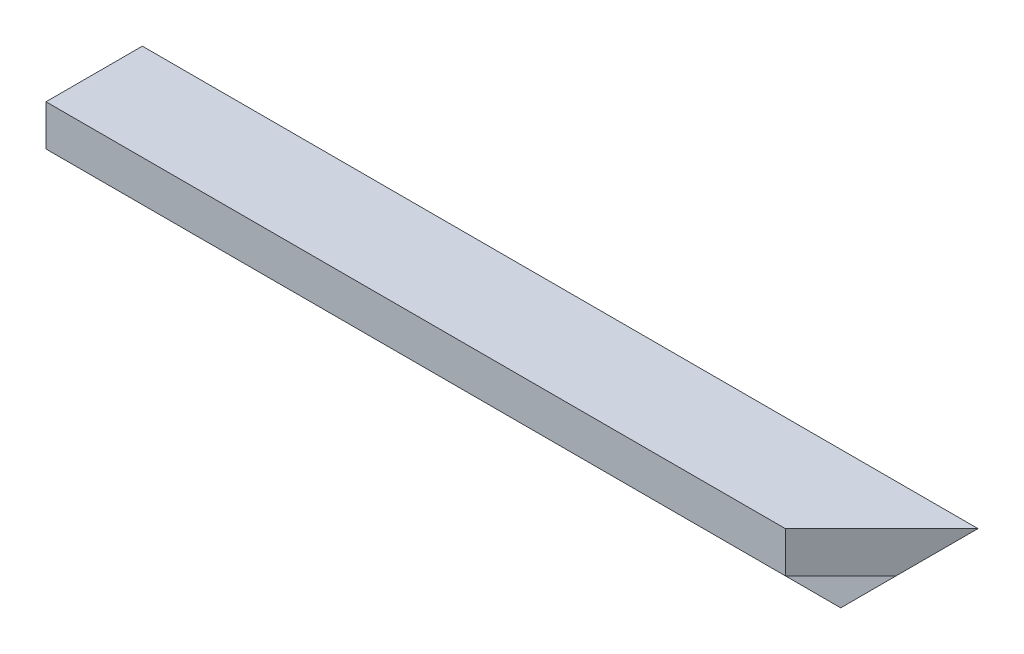
ISO-10303-21;
HEADER;
FILE_DESCRIPTION(('STEP AP214'),'2;1');
FILE_NAME('part.step','',(''),(''),'','','');
FILE_SCHEMA(('AUTOMOTIVE_DESIGN { 1 0 10303 214 1 1 1 1 }'));
ENDSEC;
DATA;
#1=APPLICATION_CONTEXT('core data for automotive mechanical design processes');
#2=APPLICATION_PROTOCOL_DEFINITION('international standard','automotive_design',2000,#1);
#3=PRODUCT_CONTEXT('',#1,'mechanical');
#4=PRODUCT('Part','Part','',(#3));
#5=PRODUCT_RELATED_PRODUCT_CATEGORY('part','',(#4));
#6=PRODUCT_DEFINITION_FORMATION('','',#4);
#7=PRODUCT_DEFINITION_CONTEXT('part definition',#1,'design');
#8=PRODUCT_DEFINITION('design','',#6,#7);
#9=PRODUCT_DEFINITION_SHAPE('','',#8);
#10=(LENGTH_UNIT() NAMED_UNIT(*) SI_UNIT(.MILLI.,.METRE.));
#11=(NAMED_UNIT(*) PLANE_ANGLE_UNIT() SI_UNIT($,.RADIAN.));
#12=(NAMED_UNIT(*) SI_UNIT($,.STERADIAN.) SOLID_ANGLE_UNIT());
#13=UNCERTAINTY_MEASURE_WITH_UNIT(LENGTH_MEASURE(1.E-05),#10,'distance_accuracy_value','');
#14=(GEOMETRIC_REPRESENTATION_CONTEXT(3) GLOBAL_UNCERTAINTY_ASSIGNED_CONTEXT((#13)) GLOBAL_UNIT_ASSIGNED_CONTEXT((#10,
#11,#12)) REPRESENTATION_CONTEXT('',''));
#15=CARTESIAN_POINT('',(0.,0.,0.));
#16=DIRECTION('',(0.,0.,1.));
#17=DIRECTION('',(1.,0.,0.));
#18=AXIS2_PLACEMENT_3D('',#15,#16,#17);
#19=CARTESIAN_POINT('',(-346.999999999999,-40.,0.));
#20=DIRECTION('',(0.,0.,-1.));
#21=DIRECTION('',(-1.,0.,0.));
#22=AXIS2_PLACEMENT_3D('',#19,#20,#21);
#23=PLANE('',#22);
#24=DIRECTION('',(0.707106781186548,0.707106781186548,0.));
#25=VECTOR('',#24,1.);
#26=CARTESIAN_POINT('',(0.,0.,0.));
#27=LINE('',#26,#25);
#28=CARTESIAN_POINT('',(-40.,-40.,0.));
#29=VERTEX_POINT('',#28);
#30=CARTESIAN_POINT('',(0.,0.,0.));
#31=VERTEX_POINT('',#30);
#32=EDGE_CURVE('E88',#29,#31,#27,.T.);
#33=ORIENTED_EDGE('',*,*,#32,.F.);
#34=DIRECTION('',(1.,0.,0.));
#35=VECTOR('',#34,1.);
#36=CARTESIAN_POINT('',(-346.999999999999,-40.,0.));
#37=LINE('',#36,#35);
#38=CARTESIAN_POINT('',(-346.999999999999,-40.,0.));
#39=VERTEX_POINT('',#38);
#40=EDGE_CURVE('E40',#39,#29,#37,.T.);
#41=ORIENTED_EDGE('',*,*,#40,.F.);
#42=DIRECTION('',(0.,1.,0.));
#43=VECTOR('',#42,1.);
#44=CARTESIAN_POINT('',(-346.999999999999,-40.,0.));
#45=LINE('',#44,#43);
#46=CARTESIAN_POINT('',(-346.999999999999,0.,0.));
#47=VERTEX_POINT('',#46);
#48=EDGE_CURVE('E124',#39,#47,#45,.T.);
#49=ORIENTED_EDGE('',*,*,#48,.T.);
#50=DIRECTION('',(1.,0.,0.));
#51=VECTOR('',#50,1.);
#52=CARTESIAN_POINT('',(-346.999999999999,0.,0.));
#53=LINE('',#52,#51);
#54=EDGE_CURVE('E93',#47,#31,#53,.T.);
#55=ORIENTED_EDGE('',*,*,#54,.T.);
#56=EDGE_LOOP('',(#33,#41,#49,#55));
#57=FACE_BOUND('',#56,.T.);
#58=ADVANCED_FACE('F33',(#57),#23,.T.);
#59=CARTESIAN_POINT('',(-346.999999999999,-40.,17.));
#60=DIRECTION('',(0.,-1.,0.));
#61=DIRECTION('',(0.,0.,-1.));
#62=AXIS2_PLACEMENT_3D('',#59,#60,#61);
#63=PLANE('',#62);
#64=DIRECTION('',(0.,0.,-1.));
#65=VECTOR('',#64,1.);
#66=CARTESIAN_POINT('',(-40.,-40.,40.));
#67=LINE('',#66,#65);
#68=CARTESIAN_POINT('',(-40.,-40.,17.));
#69=VERTEX_POINT('',#68);
#70=EDGE_CURVE('E86',#69,#29,#67,.T.);
#71=ORIENTED_EDGE('',*,*,#70,.F.);
#72=DIRECTION('',(1.,0.,0.));
#73=VECTOR('',#72,1.);
#74=CARTESIAN_POINT('',(-346.999999999999,-40.,17.));
#75=LINE('',#74,#73);
#76=CARTESIAN_POINT('',(-346.999999999999,-40.,17.));
#77=VERTEX_POINT('',#76);
#78=EDGE_CURVE('E54',#77,#69,#75,.T.);
#79=ORIENTED_EDGE('',*,*,#78,.F.);
#80=DIRECTION('',(0.,0.,-1.));
#81=VECTOR('',#80,1.);
#82=CARTESIAN_POINT('',(-346.999999999999,-40.,17.));
#83=LINE('',#82,#81);
#84=EDGE_CURVE('E97',#77,#39,#83,.T.);
#85=ORIENTED_EDGE('',*,*,#84,.T.);
#86=ORIENTED_EDGE('',*,*,#40,.T.);
#87=EDGE_LOOP('',(#71,#79,#85,#86));
#88=FACE_BOUND('',#87,.T.);
#89=ADVANCED_FACE('F95',(#88),#63,.T.);
#90=CARTESIAN_POINT('',(-346.999999999999,-17.,17.));
#91=DIRECTION('',(0.,0.,1.));
#92=DIRECTION('',(0.,-1.,0.));
#93=AXIS2_PLACEMENT_3D('',#90,#91,#92);
#94=PLANE('',#93);
#95=DIRECTION('',(-0.707106781186548,-0.707106781186548,0.));
#96=VECTOR('',#95,1.);
#97=CARTESIAN_POINT('',(-182.,-182.,17.));
#98=LINE('',#97,#96);
#99=CARTESIAN_POINT('',(-17.,-17.,17.));
#100=VERTEX_POINT('',#99);
#101=EDGE_CURVE('E90',#100,#69,#98,.T.);
#102=ORIENTED_EDGE('',*,*,#101,.F.);
#103=DIRECTION('',(1.,0.,0.));
#104=VECTOR('',#103,1.);
#105=CARTESIAN_POINT('',(-346.999999999999,-17.,17.));
#106=LINE('',#105,#104);
#107=CARTESIAN_POINT('',(-346.999999999999,-17.,17.));
#108=VERTEX_POINT('',#107);
#109=EDGE_CURVE('E99',#108,#100,#106,.T.);
#110=ORIENTED_EDGE('',*,*,#109,.F.);
#111=DIRECTION('',(0.,-1.,0.));
#112=VECTOR('',#111,1.);
#113=CARTESIAN_POINT('',(-346.999999999999,-17.,17.));
#114=LINE('',#113,#112);
#115=EDGE_CURVE('E111',#108,#77,#114,.T.);
#116=ORIENTED_EDGE('',*,*,#115,.T.);
#117=ORIENTED_EDGE('',*,*,#78,.T.);
#118=EDGE_LOOP('',(#102,#110,#116,#117));
#119=FACE_BOUND('',#118,.T.);
#120=ADVANCED_FACE('F149',(#119),#94,.T.);
#121=CARTESIAN_POINT('',(-346.999999999999,-17.,40.));
#122=DIRECTION('',(0.,-1.,0.));
#123=DIRECTION('',(0.,0.,-1.));
#124=AXIS2_PLACEMENT_3D('',#121,#122,#123);
#125=PLANE('',#124);
#126=DIRECTION('',(0.707106781186548,0.,-0.707106781186548));
#127=VECTOR('',#126,1.);
#128=CARTESIAN_POINT('',(-193.5,-17.,193.5));
#129=LINE('',#128,#127);
#130=CARTESIAN_POINT('',(-40.,-17.,40.));
#131=VERTEX_POINT('',#130);
#132=EDGE_CURVE('E126',#131,#100,#129,.T.);
#133=ORIENTED_EDGE('',*,*,#132,.F.);
#134=DIRECTION('',(1.,0.,0.));
#135=VECTOR('',#134,1.);
#136=CARTESIAN_POINT('',(-346.999999999999,-17.,40.));
#137=LINE('',#136,#135);
#138=CARTESIAN_POINT('',(-346.999999999999,-17.,40.));
#139=VERTEX_POINT('',#138);
#140=EDGE_CURVE('E106',#139,#131,#137,.T.);
#141=ORIENTED_EDGE('',*,*,#140,.F.);
#142=DIRECTION('',(0.,0.,-1.));
#143=VECTOR('',#142,1.);
#144=CARTESIAN_POINT('',(-346.999999999999,-17.,40.));
#145=LINE('',#144,#143);
#146=EDGE_CURVE('E112',#139,#108,#145,.T.);
#147=ORIENTED_EDGE('',*,*,#146,.T.);
#148=ORIENTED_EDGE('',*,*,#109,.T.);
#149=EDGE_LOOP('',(#133,#141,#147,#148));
#150=FACE_BOUND('',#149,.T.);
#151=ADVANCED_FACE('F148',(#150),#125,.T.);
#152=CARTESIAN_POINT('',(-346.999999999999,0.,40.));
#153=DIRECTION('',(0.,0.,1.));
#154=DIRECTION('',(1.,0.,0.));
#155=AXIS2_PLACEMENT_3D('',#152,#153,#154);
#156=PLANE('',#155);
#157=DIRECTION('',(0.,1.,0.));
#158=VECTOR('',#157,1.);
#159=CARTESIAN_POINT('',(-40.,-40.,40.));
#160=LINE('',#159,#158);
#161=CARTESIAN_POINT('',(-40.,0.,40.));
#162=VERTEX_POINT('',#161);
#163=EDGE_CURVE('E129',#131,#162,#160,.T.);
#164=ORIENTED_EDGE('',*,*,#163,.T.);
#165=DIRECTION('',(1.,0.,0.));
#166=VECTOR('',#165,1.);
#167=CARTESIAN_POINT('',(-346.999999999999,0.,40.));
#168=LINE('',#167,#166);
#169=CARTESIAN_POINT('',(-346.999999999999,0.,40.));
#170=VERTEX_POINT('',#169);
#171=EDGE_CURVE('E109',#170,#162,#168,.T.);
#172=ORIENTED_EDGE('',*,*,#171,.F.);
#173=DIRECTION('',(0.,-1.,0.));
#174=VECTOR('',#173,1.);
#175=CARTESIAN_POINT('',(-346.999999999999,0.,40.));
#176=LINE('',#175,#174);
#177=EDGE_CURVE('E116',#170,#139,#176,.T.);
#178=ORIENTED_EDGE('',*,*,#177,.T.);
#179=ORIENTED_EDGE('',*,*,#140,.T.);
#180=EDGE_LOOP('',(#164,#172,#178,#179));
#181=FACE_BOUND('',#180,.T.);
#182=ADVANCED_FACE('F140',(#181),#156,.T.);
#183=CARTESIAN_POINT('',(-346.999999999999,0.,0.));
#184=DIRECTION('',(0.,1.,0.));
#185=DIRECTION('',(0.,0.,1.));
#186=AXIS2_PLACEMENT_3D('',#183,#184,#185);
#187=PLANE('',#186);
#188=DIRECTION('',(-0.707106781186548,0.,0.707106781186548));
#189=VECTOR('',#188,1.);
#190=CARTESIAN_POINT('',(-40.,0.,40.));
#191=LINE('',#190,#189);
#192=EDGE_CURVE('E132',#31,#162,#191,.T.);
#193=ORIENTED_EDGE('',*,*,#192,.F.);
#194=ORIENTED_EDGE('',*,*,#54,.F.);
#195=DIRECTION('',(0.,0.,1.));
#196=VECTOR('',#195,1.);
#197=CARTESIAN_POINT('',(-346.999999999999,0.,0.));
#198=LINE('',#197,#196);
#199=EDGE_CURVE('E121',#47,#170,#198,.T.);
#200=ORIENTED_EDGE('',*,*,#199,.T.);
#201=ORIENTED_EDGE('',*,*,#171,.T.);
#202=EDGE_LOOP('',(#193,#194,#200,#201));
#203=FACE_BOUND('',#202,.T.);
#204=ADVANCED_FACE('F142',(#203),#187,.T.);
#205=CARTESIAN_POINT('',(-346.999999999999,0.,0.));
#206=DIRECTION('',(1.,0.,0.));
#207=DIRECTION('',(0.,0.,-1.));
#208=AXIS2_PLACEMENT_3D('',#205,#206,#207);
#209=PLANE('',#208);
#210=ORIENTED_EDGE('',*,*,#48,.F.);
#211=ORIENTED_EDGE('',*,*,#84,.F.);
#212=ORIENTED_EDGE('',*,*,#115,.F.);
#213=ORIENTED_EDGE('',*,*,#146,.F.);
#214=ORIENTED_EDGE('',*,*,#177,.F.);
#215=ORIENTED_EDGE('',*,*,#199,.F.);
#216=EDGE_LOOP('',(#210,#211,#212,#213,#214,#215));
#217=FACE_BOUND('',#216,.T.);
#218=ADVANCED_FACE('F145',(#217),#209,.F.);
#219=CARTESIAN_POINT('',(-40.,-40.,40.));
#220=DIRECTION('',(-0.707106781186548,0.,-0.707106781186548));
#221=DIRECTION('',(-0.707106781186548,0.,0.707106781186548));
#222=AXIS2_PLACEMENT_3D('',#219,#220,#221);
#223=PLANE('',#222);
#224=ORIENTED_EDGE('',*,*,#132,.T.);
#225=DIRECTION('',(0.577350269189626,0.577350269189626,-0.577350269189626));
#226=VECTOR('',#225,1.);
#227=CARTESIAN_POINT('',(-40.,-40.,40.));
#228=LINE('',#227,#226);
#229=EDGE_CURVE('E11',#100,#31,#228,.T.);
#230=ORIENTED_EDGE('',*,*,#229,.T.);
#231=ORIENTED_EDGE('',*,*,#192,.T.);
#232=ORIENTED_EDGE('',*,*,#163,.F.);
#233=EDGE_LOOP('',(#224,#230,#231,#232));
#234=FACE_BOUND('',#233,.T.);
#235=ADVANCED_FACE('F136',(#234),#223,.F.);
#236=CARTESIAN_POINT('',(0.,0.,40.));
#237=DIRECTION('',(-0.707106781186548,0.707106781186548,0.));
#238=DIRECTION('',(-0.707106781186548,-0.707106781186548,0.));
#239=AXIS2_PLACEMENT_3D('',#236,#237,#238);
#240=PLANE('',#239);
#241=ORIENTED_EDGE('',*,*,#101,.T.);
#242=ORIENTED_EDGE('',*,*,#70,.T.);
#243=ORIENTED_EDGE('',*,*,#32,.T.);
#244=ORIENTED_EDGE('',*,*,#229,.F.);
#245=EDGE_LOOP('',(#241,#242,#243,#244));
#246=FACE_BOUND('',#245,.T.);
#247=ADVANCED_FACE('F87',(#246),#240,.F.);
#248=CLOSED_SHELL('',(#58,#89,#120,#151,#182,#204,#218,#235,#247));
#249=MANIFOLD_SOLID_BREP('B2',#248);
#250=ADVANCED_BREP_SHAPE_REPRESENTATION('',(#18,#249),#14);
#251=SHAPE_DEFINITION_REPRESENTATION(#9,#250);
ENDSEC;
END-ISO-10303-21;
